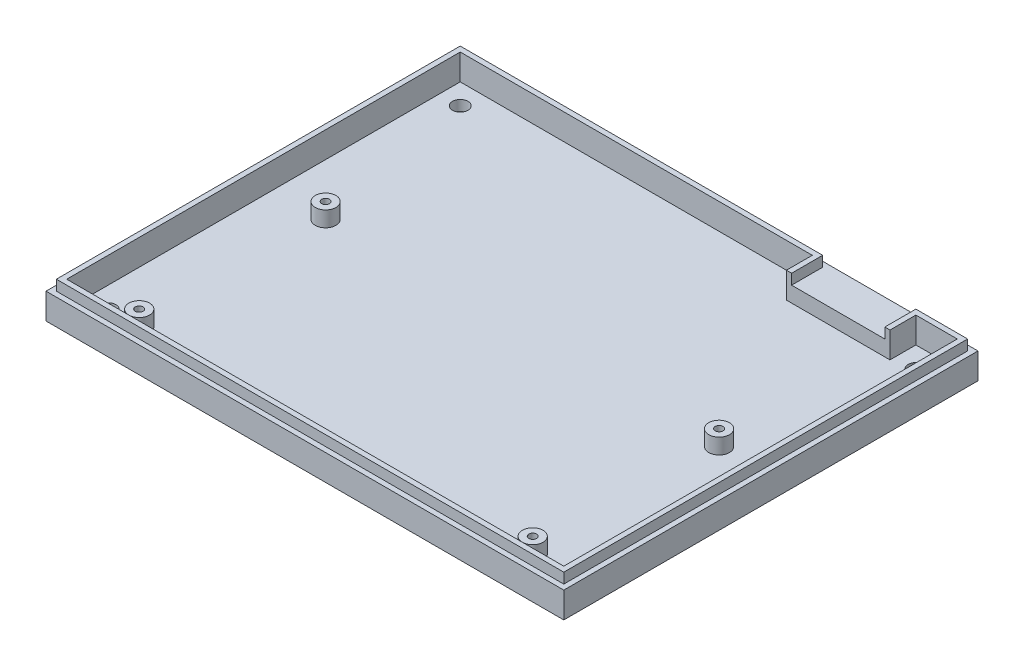
ISO-10303-21;
HEADER;
FILE_DESCRIPTION(('STEP AP214'),'2;1');
FILE_NAME('part.step','',(''),(''),'','','');
FILE_SCHEMA(('AUTOMOTIVE_DESIGN { 1 0 10303 214 1 1 1 1 }'));
ENDSEC;
DATA;
#1=APPLICATION_CONTEXT('core data for automotive mechanical design processes');
#2=APPLICATION_PROTOCOL_DEFINITION('international standard','automotive_design',2000,#1);
#3=PRODUCT_CONTEXT('',#1,'mechanical');
#4=PRODUCT('Part','Part','',(#3));
#5=PRODUCT_RELATED_PRODUCT_CATEGORY('part','',(#4));
#6=PRODUCT_DEFINITION_FORMATION('','',#4);
#7=PRODUCT_DEFINITION_CONTEXT('part definition',#1,'design');
#8=PRODUCT_DEFINITION('design','',#6,#7);
#9=PRODUCT_DEFINITION_SHAPE('','',#8);
#10=(LENGTH_UNIT() NAMED_UNIT(*) SI_UNIT(.MILLI.,.METRE.));
#11=(NAMED_UNIT(*) PLANE_ANGLE_UNIT() SI_UNIT($,.RADIAN.));
#12=(NAMED_UNIT(*) SI_UNIT($,.STERADIAN.) SOLID_ANGLE_UNIT());
#13=UNCERTAINTY_MEASURE_WITH_UNIT(LENGTH_MEASURE(1.E-05),#10,'distance_accuracy_value','');
#14=(GEOMETRIC_REPRESENTATION_CONTEXT(3) GLOBAL_UNCERTAINTY_ASSIGNED_CONTEXT((#13)) GLOBAL_UNIT_ASSIGNED_CONTEXT((#10,
#11,#12)) REPRESENTATION_CONTEXT('',''));
#15=CARTESIAN_POINT('',(0.,0.,0.));
#16=DIRECTION('',(0.,0.,1.));
#17=DIRECTION('',(1.,0.,0.));
#18=AXIS2_PLACEMENT_3D('',#15,#16,#17);
#19=CARTESIAN_POINT('',(49.,7.,-39.));
#20=DIRECTION('',(0.,0.,1.));
#21=DIRECTION('',(1.,0.,0.));
#22=AXIS2_PLACEMENT_3D('',#19,#20,#21);
#23=PLANE('',#22);
#24=DIRECTION('',(-1.,0.,0.));
#25=VECTOR('',#24,1.);
#26=CARTESIAN_POINT('',(49.,7.,-39.));
#27=LINE('',#26,#25);
#28=CARTESIAN_POINT('',(21.,7.,-39.));
#29=VERTEX_POINT('',#28);
#30=CARTESIAN_POINT('',(-49.,7.,-39.));
#31=VERTEX_POINT('',#30);
#32=EDGE_CURVE('E257',#29,#31,#27,.T.);
#33=ORIENTED_EDGE('',*,*,#32,.F.);
#34=DIRECTION('',(0.,-1.,0.));
#35=VECTOR('',#34,1.);
#36=CARTESIAN_POINT('',(21.,7.,-39.));
#37=LINE('',#36,#35);
#38=CARTESIAN_POINT('',(21.,5.,-39.));
#39=VERTEX_POINT('',#38);
#40=EDGE_CURVE('E14',#29,#39,#37,.T.);
#41=ORIENTED_EDGE('',*,*,#40,.T.);
#42=DIRECTION('',(-1.,0.,0.));
#43=VECTOR('',#42,1.);
#44=CARTESIAN_POINT('',(49.,5.,-39.));
#45=LINE('',#44,#43);
#46=CARTESIAN_POINT('',(-49.,5.,-39.));
#47=VERTEX_POINT('',#46);
#48=EDGE_CURVE('E255',#39,#47,#45,.T.);
#49=ORIENTED_EDGE('',*,*,#48,.T.);
#50=DIRECTION('',(0.,-1.,0.));
#51=VECTOR('',#50,1.);
#52=CARTESIAN_POINT('',(-49.,7.,-39.));
#53=LINE('',#52,#51);
#54=EDGE_CURVE('E276',#31,#47,#53,.T.);
#55=ORIENTED_EDGE('',*,*,#54,.F.);
#56=EDGE_LOOP('',(#33,#41,#49,#55));
#57=FACE_BOUND('',#56,.T.);
#58=ADVANCED_FACE('F105',(#57),#23,.F.);
#59=CARTESIAN_POINT('',(0.,5.,-38.));
#60=DIRECTION('',(0.,0.,1.));
#61=DIRECTION('',(1.,0.,0.));
#62=AXIS2_PLACEMENT_3D('',#59,#60,#61);
#63=PLANE('',#62);
#64=DIRECTION('',(-1.,0.,0.));
#65=VECTOR('',#64,1.);
#66=CARTESIAN_POINT('',(48.,7.,-38.));
#67=LINE('',#66,#65);
#68=CARTESIAN_POINT('',(48.,7.,-38.));
#69=VERTEX_POINT('',#68);
#70=CARTESIAN_POINT('',(40.,7.,-38.));
#71=VERTEX_POINT('',#70);
#72=EDGE_CURVE('E433',#69,#71,#67,.T.);
#73=ORIENTED_EDGE('',*,*,#72,.T.);
#74=DIRECTION('',(0.,-1.,0.));
#75=VECTOR('',#74,1.);
#76=CARTESIAN_POINT('',(40.,5.,-38.));
#77=LINE('',#76,#75);
#78=CARTESIAN_POINT('',(40.,2.,-38.));
#79=VERTEX_POINT('',#78);
#80=EDGE_CURVE('E120',#71,#79,#77,.T.);
#81=ORIENTED_EDGE('',*,*,#80,.T.);
#82=DIRECTION('',(-1.,0.,0.));
#83=VECTOR('',#82,1.);
#84=CARTESIAN_POINT('',(0.,2.,-38.));
#85=LINE('',#84,#83);
#86=CARTESIAN_POINT('',(48.,2.,-38.));
#87=VERTEX_POINT('',#86);
#88=EDGE_CURVE('E358',#87,#79,#85,.T.);
#89=ORIENTED_EDGE('',*,*,#88,.F.);
#90=DIRECTION('',(0.,-1.,0.));
#91=VECTOR('',#90,1.);
#92=CARTESIAN_POINT('',(48.,5.,-38.));
#93=LINE('',#92,#91);
#94=EDGE_CURVE('E375',#69,#87,#93,.T.);
#95=ORIENTED_EDGE('',*,*,#94,.F.);
#96=EDGE_LOOP('',(#73,#81,#89,#95));
#97=FACE_BOUND('',#96,.T.);
#98=ADVANCED_FACE('F506',(#97),#63,.T.);
#99=DIRECTION('',(0.,-1.,0.));
#100=VECTOR('',#99,1.);
#101=CARTESIAN_POINT('',(20.,5.,-38.));
#102=LINE('',#101,#100);
#103=CARTESIAN_POINT('',(20.,7.,-38.));
#104=VERTEX_POINT('',#103);
#105=CARTESIAN_POINT('',(20.,2.,-38.));
#106=VERTEX_POINT('',#105);
#107=EDGE_CURVE('E470',#104,#106,#102,.T.);
#108=ORIENTED_EDGE('',*,*,#107,.F.);
#109=CARTESIAN_POINT('',(-48.,7.,-38.));
#110=VERTEX_POINT('',#109);
#111=EDGE_CURVE('E437',#104,#110,#67,.T.);
#112=ORIENTED_EDGE('',*,*,#111,.T.);
#113=DIRECTION('',(0.,-1.,0.));
#114=VECTOR('',#113,1.);
#115=CARTESIAN_POINT('',(-48.,5.,-38.));
#116=LINE('',#115,#114);
#117=CARTESIAN_POINT('',(-48.,2.,-38.));
#118=VERTEX_POINT('',#117);
#119=EDGE_CURVE('E357',#110,#118,#116,.T.);
#120=ORIENTED_EDGE('',*,*,#119,.T.);
#121=EDGE_CURVE('E344',#106,#118,#85,.T.);
#122=ORIENTED_EDGE('',*,*,#121,.F.);
#123=EDGE_LOOP('',(#108,#112,#120,#122));
#124=FACE_BOUND('',#123,.T.);
#125=ADVANCED_FACE('F508',(#124),#63,.T.);
#126=CARTESIAN_POINT('',(0.,2.,0.));
#127=DIRECTION('',(0.,-1.,0.));
#128=DIRECTION('',(0.,0.,-1.));
#129=AXIS2_PLACEMENT_3D('',#126,#127,#128);
#130=PLANE('',#129);
#131=CARTESIAN_POINT('',(38.,2.,34.));
#132=DIRECTION('',(0.,-1.,0.));
#133=DIRECTION('',(0.,0.,-1.));
#134=AXIS2_PLACEMENT_3D('',#131,#132,#133);
#135=CIRCLE('',#134,2.);
#136=CARTESIAN_POINT('',(38.,2.,32.));
#137=VERTEX_POINT('',#136);
#138=EDGE_CURVE('E398',#137,#137,#135,.F.);
#139=ORIENTED_EDGE('',*,*,#138,.F.);
#140=EDGE_LOOP('',(#139));
#141=FACE_BOUND('',#140,.T.);
#142=CARTESIAN_POINT('',(38.,2.,-2.00000000000001));
#143=DIRECTION('',(0.,-1.,0.));
#144=DIRECTION('',(0.,0.,-1.));
#145=AXIS2_PLACEMENT_3D('',#142,#143,#144);
#146=CIRCLE('',#145,2.);
#147=CARTESIAN_POINT('',(38.,2.,-4.00000000000001));
#148=VERTEX_POINT('',#147);
#149=EDGE_CURVE('E401',#148,#148,#146,.F.);
#150=ORIENTED_EDGE('',*,*,#149,.F.);
#151=EDGE_LOOP('',(#150));
#152=FACE_BOUND('',#151,.T.);
#153=CARTESIAN_POINT('',(-38.,2.,34.));
#154=DIRECTION('',(0.,-1.,0.));
#155=DIRECTION('',(0.,0.,-1.));
#156=AXIS2_PLACEMENT_3D('',#153,#154,#155);
#157=CIRCLE('',#156,2.);
#158=CARTESIAN_POINT('',(-38.,2.,32.));
#159=VERTEX_POINT('',#158);
#160=EDGE_CURVE('E404',#159,#159,#157,.F.);
#161=ORIENTED_EDGE('',*,*,#160,.F.);
#162=EDGE_LOOP('',(#161));
#163=FACE_BOUND('',#162,.T.);
#164=CARTESIAN_POINT('',(-38.,2.,-2.));
#165=DIRECTION('',(0.,-1.,0.));
#166=DIRECTION('',(0.,0.,-1.));
#167=AXIS2_PLACEMENT_3D('',#164,#165,#166);
#168=CIRCLE('',#167,2.);
#169=CARTESIAN_POINT('',(-38.,2.,-4.));
#170=VERTEX_POINT('',#169);
#171=EDGE_CURVE('E407',#170,#170,#168,.F.);
#172=ORIENTED_EDGE('',*,*,#171,.F.);
#173=EDGE_LOOP('',(#172));
#174=FACE_BOUND('',#173,.T.);
#175=CARTESIAN_POINT('',(-44.,2.,-34.));
#176=DIRECTION('',(0.,1.,0.));
#177=DIRECTION('',(0.,0.,1.));
#178=AXIS2_PLACEMENT_3D('',#175,#176,#177);
#179=CIRCLE('',#178,1.5);
#180=CARTESIAN_POINT('',(-44.,2.,-32.5));
#181=VERTEX_POINT('',#180);
#182=EDGE_CURVE('E302',#181,#181,#179,.T.);
#183=ORIENTED_EDGE('',*,*,#182,.F.);
#184=EDGE_LOOP('',(#183));
#185=FACE_BOUND('',#184,.T.);
#186=CARTESIAN_POINT('',(-44.,2.,34.));
#187=DIRECTION('',(0.,1.,0.));
#188=DIRECTION('',(0.,0.,-1.));
#189=AXIS2_PLACEMENT_3D('',#186,#187,#188);
#190=CIRCLE('',#189,1.5);
#191=CARTESIAN_POINT('',(-44.,2.,32.5));
#192=VERTEX_POINT('',#191);
#193=EDGE_CURVE('E284',#192,#192,#190,.T.);
#194=ORIENTED_EDGE('',*,*,#193,.F.);
#195=EDGE_LOOP('',(#194));
#196=FACE_BOUND('',#195,.T.);
#197=CARTESIAN_POINT('',(44.0000000000001,2.,33.9999999999999));
#198=DIRECTION('',(0.,1.,0.));
#199=DIRECTION('',(0.,0.,1.));
#200=AXIS2_PLACEMENT_3D('',#197,#198,#199);
#201=CIRCLE('',#200,1.50000000000001);
#202=CARTESIAN_POINT('',(44.0000000000001,2.,35.4999999999999));
#203=VERTEX_POINT('',#202);
#204=EDGE_CURVE('E289',#203,#203,#201,.T.);
#205=ORIENTED_EDGE('',*,*,#204,.F.);
#206=EDGE_LOOP('',(#205));
#207=FACE_BOUND('',#206,.T.);
#208=CARTESIAN_POINT('',(44.,2.,-34.));
#209=DIRECTION('',(0.,1.,0.));
#210=DIRECTION('',(0.,0.,-1.));
#211=AXIS2_PLACEMENT_3D('',#208,#209,#210);
#212=CIRCLE('',#211,1.50000000000001);
#213=CARTESIAN_POINT('',(44.,2.,-35.5));
#214=VERTEX_POINT('',#213);
#215=EDGE_CURVE('E285',#214,#214,#212,.T.);
#216=ORIENTED_EDGE('',*,*,#215,.F.);
#217=EDGE_LOOP('',(#216));
#218=FACE_BOUND('',#217,.T.);
#219=DIRECTION('',(0.,0.,1.));
#220=VECTOR('',#219,1.);
#221=CARTESIAN_POINT('',(20.,2.,-33.));
#222=LINE('',#221,#220);
#223=CARTESIAN_POINT('',(20.,2.,-33.));
#224=VERTEX_POINT('',#223);
#225=EDGE_CURVE('E468',#106,#224,#222,.T.);
#226=ORIENTED_EDGE('',*,*,#225,.F.);
#227=ORIENTED_EDGE('',*,*,#121,.T.);
#228=DIRECTION('',(0.,0.,1.));
#229=VECTOR('',#228,1.);
#230=CARTESIAN_POINT('',(-48.,2.,0.));
#231=LINE('',#230,#229);
#232=CARTESIAN_POINT('',(-48.,2.,38.));
#233=VERTEX_POINT('',#232);
#234=EDGE_CURVE('E348',#118,#233,#231,.T.);
#235=ORIENTED_EDGE('',*,*,#234,.T.);
#236=DIRECTION('',(1.,0.,0.));
#237=VECTOR('',#236,1.);
#238=CARTESIAN_POINT('',(0.,2.,38.));
#239=LINE('',#238,#237);
#240=CARTESIAN_POINT('',(48.,2.,38.));
#241=VERTEX_POINT('',#240);
#242=EDGE_CURVE('E363',#233,#241,#239,.T.);
#243=ORIENTED_EDGE('',*,*,#242,.T.);
#244=DIRECTION('',(0.,0.,-1.));
#245=VECTOR('',#244,1.);
#246=CARTESIAN_POINT('',(48.,2.,0.));
#247=LINE('',#246,#245);
#248=EDGE_CURVE('E360',#241,#87,#247,.T.);
#249=ORIENTED_EDGE('',*,*,#248,.T.);
#250=ORIENTED_EDGE('',*,*,#88,.T.);
#251=DIRECTION('',(0.,0.,-1.));
#252=VECTOR('',#251,1.);
#253=CARTESIAN_POINT('',(40.,2.,-38.));
#254=LINE('',#253,#252);
#255=CARTESIAN_POINT('',(40.,2.,-33.));
#256=VERTEX_POINT('',#255);
#257=EDGE_CURVE('E471',#256,#79,#254,.T.);
#258=ORIENTED_EDGE('',*,*,#257,.F.);
#259=DIRECTION('',(1.,0.,0.));
#260=VECTOR('',#259,1.);
#261=CARTESIAN_POINT('',(40.,2.,-33.));
#262=LINE('',#261,#260);
#263=EDGE_CURVE('E474',#224,#256,#262,.T.);
#264=ORIENTED_EDGE('',*,*,#263,.F.);
#265=EDGE_LOOP('',(#226,#227,#235,#243,#249,#250,#258,#264));
#266=FACE_BOUND('',#265,.T.);
#267=ADVANCED_FACE('F504',(#141,#152,#163,#174,#185,#196,#207,#218,#266),#130,.F.);
#268=CARTESIAN_POINT('',(0.,5.,0.));
#269=DIRECTION('',(0.,1.,0.));
#270=DIRECTION('',(0.,0.,1.));
#271=AXIS2_PLACEMENT_3D('',#268,#269,#270);
#272=PLANE('',#271);
#273=ORIENTED_EDGE('',*,*,#48,.F.);
#274=DIRECTION('',(0.,0.,-1.));
#275=VECTOR('',#274,1.);
#276=CARTESIAN_POINT('',(21.,5.,-38.));
#277=LINE('',#276,#275);
#278=CARTESIAN_POINT('',(21.,5.,-33.));
#279=VERTEX_POINT('',#278);
#280=EDGE_CURVE('E244',#279,#39,#277,.T.);
#281=ORIENTED_EDGE('',*,*,#280,.F.);
#282=DIRECTION('',(1.,0.,0.));
#283=VECTOR('',#282,1.);
#284=CARTESIAN_POINT('',(40.,5.,-33.));
#285=LINE('',#284,#283);
#286=CARTESIAN_POINT('',(39.,5.,-33.));
#287=VERTEX_POINT('',#286);
#288=EDGE_CURVE('E128',#279,#287,#285,.T.);
#289=ORIENTED_EDGE('',*,*,#288,.T.);
#290=DIRECTION('',(0.,0.,1.));
#291=VECTOR('',#290,1.);
#292=CARTESIAN_POINT('',(39.,5.,-38.));
#293=LINE('',#292,#291);
#294=CARTESIAN_POINT('',(39.,5.,-39.));
#295=VERTEX_POINT('',#294);
#296=EDGE_CURVE('E451',#295,#287,#293,.T.);
#297=ORIENTED_EDGE('',*,*,#296,.F.);
#298=CARTESIAN_POINT('',(49.,5.,-39.));
#299=VERTEX_POINT('',#298);
#300=EDGE_CURVE('E263',#299,#295,#45,.T.);
#301=ORIENTED_EDGE('',*,*,#300,.F.);
#302=DIRECTION('',(0.,0.,-1.));
#303=VECTOR('',#302,1.);
#304=CARTESIAN_POINT('',(49.,5.,39.));
#305=LINE('',#304,#303);
#306=CARTESIAN_POINT('',(49.,5.,39.));
#307=VERTEX_POINT('',#306);
#308=EDGE_CURVE('E264',#307,#299,#305,.T.);
#309=ORIENTED_EDGE('',*,*,#308,.F.);
#310=DIRECTION('',(1.,0.,0.));
#311=VECTOR('',#310,1.);
#312=CARTESIAN_POINT('',(-49.,5.,39.));
#313=LINE('',#312,#311);
#314=CARTESIAN_POINT('',(-49.,5.,39.));
#315=VERTEX_POINT('',#314);
#316=EDGE_CURVE('E267',#315,#307,#313,.T.);
#317=ORIENTED_EDGE('',*,*,#316,.F.);
#318=DIRECTION('',(0.,0.,1.));
#319=VECTOR('',#318,1.);
#320=CARTESIAN_POINT('',(-49.,5.,-39.));
#321=LINE('',#320,#319);
#322=EDGE_CURVE('E262',#47,#315,#321,.T.);
#323=ORIENTED_EDGE('',*,*,#322,.F.);
#324=EDGE_LOOP('',(#273,#281,#289,#297,#301,#309,#317,#323));
#325=FACE_BOUND('',#324,.T.);
#326=DIRECTION('',(-1.,0.,0.));
#327=VECTOR('',#326,1.);
#328=CARTESIAN_POINT('',(0.,5.,-40.));
#329=LINE('',#328,#327);
#330=CARTESIAN_POINT('',(50.,5.,-40.));
#331=VERTEX_POINT('',#330);
#332=CARTESIAN_POINT('',(-50.,5.,-40.));
#333=VERTEX_POINT('',#332);
#334=EDGE_CURVE('E345',#331,#333,#329,.T.);
#335=ORIENTED_EDGE('',*,*,#334,.T.);
#336=DIRECTION('',(0.,0.,1.));
#337=VECTOR('',#336,1.);
#338=CARTESIAN_POINT('',(-50.,5.,0.));
#339=LINE('',#338,#337);
#340=CARTESIAN_POINT('',(-50.,5.,40.));
#341=VERTEX_POINT('',#340);
#342=EDGE_CURVE('E347',#333,#341,#339,.T.);
#343=ORIENTED_EDGE('',*,*,#342,.T.);
#344=DIRECTION('',(1.,0.,0.));
#345=VECTOR('',#344,1.);
#346=CARTESIAN_POINT('',(0.,5.,40.));
#347=LINE('',#346,#345);
#348=CARTESIAN_POINT('',(50.,5.,40.));
#349=VERTEX_POINT('',#348);
#350=EDGE_CURVE('E351',#341,#349,#347,.T.);
#351=ORIENTED_EDGE('',*,*,#350,.T.);
#352=DIRECTION('',(0.,0.,-1.));
#353=VECTOR('',#352,1.);
#354=CARTESIAN_POINT('',(50.,5.,0.));
#355=LINE('',#354,#353);
#356=EDGE_CURVE('E354',#349,#331,#355,.T.);
#357=ORIENTED_EDGE('',*,*,#356,.T.);
#358=EDGE_LOOP('',(#335,#343,#351,#357));
#359=FACE_BOUND('',#358,.T.);
#360=ADVANCED_FACE('F259',(#325,#359),#272,.T.);
#361=CARTESIAN_POINT('',(-50.,2.,-40.));
#362=DIRECTION('',(1.,0.,0.));
#363=DIRECTION('',(0.,0.,-1.));
#364=AXIS2_PLACEMENT_3D('',#361,#362,#363);
#365=PLANE('',#364);
#366=DIRECTION('',(0.,0.,1.));
#367=VECTOR('',#366,1.);
#368=CARTESIAN_POINT('',(-50.,0.,-40.));
#369=LINE('',#368,#367);
#370=CARTESIAN_POINT('',(-50.,0.,-40.));
#371=VERTEX_POINT('',#370);
#372=CARTESIAN_POINT('',(-50.,0.,40.));
#373=VERTEX_POINT('',#372);
#374=EDGE_CURVE('E377',#371,#373,#369,.T.);
#375=ORIENTED_EDGE('',*,*,#374,.T.);
#376=DIRECTION('',(0.,-1.,0.));
#377=VECTOR('',#376,1.);
#378=CARTESIAN_POINT('',(-50.,2.,40.));
#379=LINE('',#378,#377);
#380=EDGE_CURVE('E395',#341,#373,#379,.T.);
#381=ORIENTED_EDGE('',*,*,#380,.F.);
#382=ORIENTED_EDGE('',*,*,#342,.F.);
#383=DIRECTION('',(0.,-1.,0.));
#384=VECTOR('',#383,1.);
#385=CARTESIAN_POINT('',(-50.,2.,-40.));
#386=LINE('',#385,#384);
#387=EDGE_CURVE('E386',#333,#371,#386,.T.);
#388=ORIENTED_EDGE('',*,*,#387,.T.);
#389=EDGE_LOOP('',(#375,#381,#382,#388));
#390=FACE_BOUND('',#389,.T.);
#391=ADVANCED_FACE('F107',(#390),#365,.F.);
#392=CARTESIAN_POINT('',(50.,2.,40.));
#393=DIRECTION('',(0.,0.,-1.));
#394=DIRECTION('',(-1.,0.,0.));
#395=AXIS2_PLACEMENT_3D('',#392,#393,#394);
#396=PLANE('',#395);
#397=DIRECTION('',(1.,0.,0.));
#398=VECTOR('',#397,1.);
#399=CARTESIAN_POINT('',(50.,0.,40.));
#400=LINE('',#399,#398);
#401=CARTESIAN_POINT('',(50.,0.,40.));
#402=VERTEX_POINT('',#401);
#403=EDGE_CURVE('E380',#373,#402,#400,.T.);
#404=ORIENTED_EDGE('',*,*,#403,.T.);
#405=DIRECTION('',(0.,-1.,0.));
#406=VECTOR('',#405,1.);
#407=CARTESIAN_POINT('',(50.,2.,40.));
#408=LINE('',#407,#406);
#409=EDGE_CURVE('E392',#349,#402,#408,.T.);
#410=ORIENTED_EDGE('',*,*,#409,.F.);
#411=ORIENTED_EDGE('',*,*,#350,.F.);
#412=ORIENTED_EDGE('',*,*,#380,.T.);
#413=EDGE_LOOP('',(#404,#410,#411,#412));
#414=FACE_BOUND('',#413,.T.);
#415=ADVANCED_FACE('F532',(#414),#396,.F.);
#416=CARTESIAN_POINT('',(50.,2.,-40.));
#417=DIRECTION('',(-1.,0.,0.));
#418=DIRECTION('',(0.,0.,1.));
#419=AXIS2_PLACEMENT_3D('',#416,#417,#418);
#420=PLANE('',#419);
#421=DIRECTION('',(0.,0.,-1.));
#422=VECTOR('',#421,1.);
#423=CARTESIAN_POINT('',(50.,0.,-40.));
#424=LINE('',#423,#422);
#425=CARTESIAN_POINT('',(50.,0.,-40.));
#426=VERTEX_POINT('',#425);
#427=EDGE_CURVE('E382',#402,#426,#424,.T.);
#428=ORIENTED_EDGE('',*,*,#427,.T.);
#429=DIRECTION('',(0.,-1.,0.));
#430=VECTOR('',#429,1.);
#431=CARTESIAN_POINT('',(50.,2.,-40.));
#432=LINE('',#431,#430);
#433=EDGE_CURVE('E389',#331,#426,#432,.T.);
#434=ORIENTED_EDGE('',*,*,#433,.F.);
#435=ORIENTED_EDGE('',*,*,#356,.F.);
#436=ORIENTED_EDGE('',*,*,#409,.T.);
#437=EDGE_LOOP('',(#428,#434,#435,#436));
#438=FACE_BOUND('',#437,.T.);
#439=ADVANCED_FACE('F529',(#438),#420,.F.);
#440=CARTESIAN_POINT('',(50.,2.,-40.));
#441=DIRECTION('',(0.,0.,1.));
#442=DIRECTION('',(1.,0.,0.));
#443=AXIS2_PLACEMENT_3D('',#440,#441,#442);
#444=PLANE('',#443);
#445=DIRECTION('',(-1.,0.,0.));
#446=VECTOR('',#445,1.);
#447=CARTESIAN_POINT('',(50.,0.,-40.));
#448=LINE('',#447,#446);
#449=EDGE_CURVE('E384',#426,#371,#448,.T.);
#450=ORIENTED_EDGE('',*,*,#449,.T.);
#451=ORIENTED_EDGE('',*,*,#387,.F.);
#452=ORIENTED_EDGE('',*,*,#334,.F.);
#453=ORIENTED_EDGE('',*,*,#433,.T.);
#454=EDGE_LOOP('',(#450,#451,#452,#453));
#455=FACE_BOUND('',#454,.T.);
#456=ADVANCED_FACE('F525',(#455),#444,.F.);
#457=CARTESIAN_POINT('',(0.,0.,0.));
#458=DIRECTION('',(0.,-1.,0.));
#459=DIRECTION('',(0.,0.,-1.));
#460=AXIS2_PLACEMENT_3D('',#457,#458,#459);
#461=PLANE('',#460);
#462=CARTESIAN_POINT('',(44.,0.,-34.));
#463=DIRECTION('',(0.,-1.,0.));
#464=DIRECTION('',(0.,0.,-1.));
#465=AXIS2_PLACEMENT_3D('',#462,#463,#464);
#466=CIRCLE('',#465,1.50000000000001);
#467=CARTESIAN_POINT('',(44.,0.,-35.5));
#468=VERTEX_POINT('',#467);
#469=EDGE_CURVE('E299',#468,#468,#466,.T.);
#470=ORIENTED_EDGE('',*,*,#469,.F.);
#471=EDGE_LOOP('',(#470));
#472=FACE_BOUND('',#471,.T.);
#473=CARTESIAN_POINT('',(44.0000000000001,0.,33.9999999999999));
#474=DIRECTION('',(0.,-1.,0.));
#475=DIRECTION('',(0.,0.,-1.));
#476=AXIS2_PLACEMENT_3D('',#473,#474,#475);
#477=CIRCLE('',#476,1.50000000000001);
#478=CARTESIAN_POINT('',(44.0000000000001,0.,32.4999999999999));
#479=VERTEX_POINT('',#478);
#480=EDGE_CURVE('E296',#479,#479,#477,.T.);
#481=ORIENTED_EDGE('',*,*,#480,.F.);
#482=EDGE_LOOP('',(#481));
#483=FACE_BOUND('',#482,.T.);
#484=CARTESIAN_POINT('',(-44.,0.,34.));
#485=DIRECTION('',(0.,-1.,0.));
#486=DIRECTION('',(0.,0.,-1.));
#487=AXIS2_PLACEMENT_3D('',#484,#485,#486);
#488=CIRCLE('',#487,1.5);
#489=CARTESIAN_POINT('',(-44.,0.,32.5));
#490=VERTEX_POINT('',#489);
#491=EDGE_CURVE('E288',#490,#490,#488,.T.);
#492=ORIENTED_EDGE('',*,*,#491,.F.);
#493=EDGE_LOOP('',(#492));
#494=FACE_BOUND('',#493,.T.);
#495=CARTESIAN_POINT('',(-44.,0.,-34.));
#496=DIRECTION('',(0.,-1.,0.));
#497=DIRECTION('',(0.,0.,-1.));
#498=AXIS2_PLACEMENT_3D('',#495,#496,#497);
#499=CIRCLE('',#498,1.5);
#500=CARTESIAN_POINT('',(-44.,0.,-35.5));
#501=VERTEX_POINT('',#500);
#502=EDGE_CURVE('E305',#501,#501,#499,.T.);
#503=ORIENTED_EDGE('',*,*,#502,.F.);
#504=EDGE_LOOP('',(#503));
#505=FACE_BOUND('',#504,.T.);
#506=CARTESIAN_POINT('',(-38.,0.,-2.));
#507=DIRECTION('',(0.,1.,0.));
#508=DIRECTION('',(0.,0.,1.));
#509=AXIS2_PLACEMENT_3D('',#506,#507,#508);
#510=CIRCLE('',#509,0.749999999999999);
#511=CARTESIAN_POINT('',(-38.,0.,-1.25));
#512=VERTEX_POINT('',#511);
#513=EDGE_CURVE('E316',#512,#512,#510,.T.);
#514=ORIENTED_EDGE('',*,*,#513,.T.);
#515=EDGE_LOOP('',(#514));
#516=FACE_BOUND('',#515,.T.);
#517=CARTESIAN_POINT('',(38.,0.,34.));
#518=DIRECTION('',(0.,1.,0.));
#519=DIRECTION('',(0.,0.,1.));
#520=AXIS2_PLACEMENT_3D('',#517,#518,#519);
#521=CIRCLE('',#520,0.749999999999999);
#522=CARTESIAN_POINT('',(38.,0.,34.75));
#523=VERTEX_POINT('',#522);
#524=EDGE_CURVE('E309',#523,#523,#521,.T.);
#525=ORIENTED_EDGE('',*,*,#524,.T.);
#526=EDGE_LOOP('',(#525));
#527=FACE_BOUND('',#526,.T.);
#528=CARTESIAN_POINT('',(38.,0.,-2.00000000000001));
#529=DIRECTION('',(0.,1.,0.));
#530=DIRECTION('',(0.,0.,1.));
#531=AXIS2_PLACEMENT_3D('',#528,#529,#530);
#532=CIRCLE('',#531,0.749999999999999);
#533=CARTESIAN_POINT('',(38.,0.,-1.25000000000001));
#534=VERTEX_POINT('',#533);
#535=EDGE_CURVE('E321',#534,#534,#532,.T.);
#536=ORIENTED_EDGE('',*,*,#535,.T.);
#537=EDGE_LOOP('',(#536));
#538=FACE_BOUND('',#537,.T.);
#539=CARTESIAN_POINT('',(-38.,0.,34.));
#540=DIRECTION('',(0.,1.,0.));
#541=DIRECTION('',(0.,0.,1.));
#542=AXIS2_PLACEMENT_3D('',#539,#540,#541);
#543=CIRCLE('',#542,0.749999999999999);
#544=CARTESIAN_POINT('',(-38.,0.,34.75));
#545=VERTEX_POINT('',#544);
#546=EDGE_CURVE('E327',#545,#545,#543,.T.);
#547=ORIENTED_EDGE('',*,*,#546,.T.);
#548=EDGE_LOOP('',(#547));
#549=FACE_BOUND('',#548,.T.);
#550=ORIENTED_EDGE('',*,*,#374,.F.);
#551=ORIENTED_EDGE('',*,*,#449,.F.);
#552=ORIENTED_EDGE('',*,*,#427,.F.);
#553=ORIENTED_EDGE('',*,*,#403,.F.);
#554=EDGE_LOOP('',(#550,#551,#552,#553));
#555=FACE_BOUND('',#554,.T.);
#556=ADVANCED_FACE('F522',(#472,#483,#494,#505,#516,#527,#538,#549,#555),#461,.T.);
#557=CARTESIAN_POINT('',(48.,5.,0.));
#558=DIRECTION('',(-1.,0.,0.));
#559=DIRECTION('',(0.,0.,1.));
#560=AXIS2_PLACEMENT_3D('',#557,#558,#559);
#561=PLANE('',#560);
#562=ORIENTED_EDGE('',*,*,#248,.F.);
#563=DIRECTION('',(0.,-1.,0.));
#564=VECTOR('',#563,1.);
#565=CARTESIAN_POINT('',(48.,5.,38.));
#566=LINE('',#565,#564);
#567=CARTESIAN_POINT('',(48.,7.,38.));
#568=VERTEX_POINT('',#567);
#569=EDGE_CURVE('E373',#568,#241,#566,.T.);
#570=ORIENTED_EDGE('',*,*,#569,.F.);
#571=DIRECTION('',(0.,0.,-1.));
#572=VECTOR('',#571,1.);
#573=CARTESIAN_POINT('',(48.,7.,38.));
#574=LINE('',#573,#572);
#575=EDGE_CURVE('E442',#568,#69,#574,.T.);
#576=ORIENTED_EDGE('',*,*,#575,.T.);
#577=ORIENTED_EDGE('',*,*,#94,.T.);
#578=EDGE_LOOP('',(#562,#570,#576,#577));
#579=FACE_BOUND('',#578,.T.);
#580=ADVANCED_FACE('F497',(#579),#561,.T.);
#581=CARTESIAN_POINT('',(0.,5.,38.));
#582=DIRECTION('',(0.,0.,-1.));
#583=DIRECTION('',(-1.,0.,0.));
#584=AXIS2_PLACEMENT_3D('',#581,#582,#583);
#585=PLANE('',#584);
#586=ORIENTED_EDGE('',*,*,#242,.F.);
#587=DIRECTION('',(0.,-1.,0.));
#588=VECTOR('',#587,1.);
#589=CARTESIAN_POINT('',(-48.,5.,38.));
#590=LINE('',#589,#588);
#591=CARTESIAN_POINT('',(-48.,7.,38.));
#592=VERTEX_POINT('',#591);
#593=EDGE_CURVE('E370',#592,#233,#590,.T.);
#594=ORIENTED_EDGE('',*,*,#593,.F.);
#595=DIRECTION('',(1.,0.,0.));
#596=VECTOR('',#595,1.);
#597=CARTESIAN_POINT('',(-48.,7.,38.));
#598=LINE('',#597,#596);
#599=EDGE_CURVE('E489',#592,#568,#598,.T.);
#600=ORIENTED_EDGE('',*,*,#599,.T.);
#601=ORIENTED_EDGE('',*,*,#569,.T.);
#602=EDGE_LOOP('',(#586,#594,#600,#601));
#603=FACE_BOUND('',#602,.T.);
#604=ADVANCED_FACE('F559',(#603),#585,.T.);
#605=CARTESIAN_POINT('',(-48.,5.,0.));
#606=DIRECTION('',(1.,0.,0.));
#607=DIRECTION('',(0.,0.,-1.));
#608=AXIS2_PLACEMENT_3D('',#605,#606,#607);
#609=PLANE('',#608);
#610=ORIENTED_EDGE('',*,*,#234,.F.);
#611=ORIENTED_EDGE('',*,*,#119,.F.);
#612=DIRECTION('',(0.,0.,1.));
#613=VECTOR('',#612,1.);
#614=CARTESIAN_POINT('',(-48.,7.,-38.));
#615=LINE('',#614,#613);
#616=EDGE_CURVE('E487',#110,#592,#615,.T.);
#617=ORIENTED_EDGE('',*,*,#616,.T.);
#618=ORIENTED_EDGE('',*,*,#593,.T.);
#619=EDGE_LOOP('',(#610,#611,#617,#618));
#620=FACE_BOUND('',#619,.T.);
#621=ADVANCED_FACE('F557',(#620),#609,.T.);
#622=CARTESIAN_POINT('',(38.,5.,34.));
#623=DIRECTION('',(0.,-1.,0.));
#624=DIRECTION('',(0.,0.,-1.));
#625=AXIS2_PLACEMENT_3D('',#622,#623,#624);
#626=CYLINDRICAL_SURFACE('',#625,2.);
#627=CARTESIAN_POINT('',(38.,5.,34.));
#628=DIRECTION('',(0.,1.,0.));
#629=DIRECTION('',(0.,0.,1.));
#630=AXIS2_PLACEMENT_3D('',#627,#628,#629);
#631=CIRCLE('',#630,2.);
#632=CARTESIAN_POINT('',(38.,5.,36.));
#633=VERTEX_POINT('',#632);
#634=EDGE_CURVE('E341',#633,#633,#631,.T.);
#635=ORIENTED_EDGE('',*,*,#634,.F.);
#636=EDGE_LOOP('',(#635));
#637=FACE_BOUND('',#636,.T.);
#638=ORIENTED_EDGE('',*,*,#138,.T.);
#639=EDGE_LOOP('',(#638));
#640=FACE_BOUND('',#639,.T.);
#641=ADVANCED_FACE('F555',(#637,#640),#626,.T.);
#642=CARTESIAN_POINT('',(0.,5.,0.));
#643=DIRECTION('',(0.,1.,0.));
#644=DIRECTION('',(0.,0.,1.));
#645=AXIS2_PLACEMENT_3D('',#642,#643,#644);
#646=PLANE('',#645);
#647=CARTESIAN_POINT('',(38.,5.,34.));
#648=DIRECTION('',(0.,1.,0.));
#649=DIRECTION('',(0.,0.,1.));
#650=AXIS2_PLACEMENT_3D('',#647,#648,#649);
#651=CIRCLE('',#650,0.749999999999999);
#652=CARTESIAN_POINT('',(38.,5.,34.75));
#653=VERTEX_POINT('',#652);
#654=EDGE_CURVE('E313',#653,#653,#651,.T.);
#655=ORIENTED_EDGE('',*,*,#654,.F.);
#656=EDGE_LOOP('',(#655));
#657=FACE_BOUND('',#656,.T.);
#658=ORIENTED_EDGE('',*,*,#634,.T.);
#659=EDGE_LOOP('',(#658));
#660=FACE_BOUND('',#659,.T.);
#661=ADVANCED_FACE('F645',(#657,#660),#646,.T.);
#662=CARTESIAN_POINT('',(38.,5.,-2.00000000000001));
#663=DIRECTION('',(0.,-1.,0.));
#664=DIRECTION('',(0.,0.,-1.));
#665=AXIS2_PLACEMENT_3D('',#662,#663,#664);
#666=CYLINDRICAL_SURFACE('',#665,2.);
#667=CARTESIAN_POINT('',(38.,5.,-2.00000000000001));
#668=DIRECTION('',(0.,1.,0.));
#669=DIRECTION('',(0.,0.,1.));
#670=AXIS2_PLACEMENT_3D('',#667,#668,#669);
#671=CIRCLE('',#670,2.);
#672=CARTESIAN_POINT('',(38.,5.,0.));
#673=VERTEX_POINT('',#672);
#674=EDGE_CURVE('E338',#673,#673,#671,.T.);
#675=ORIENTED_EDGE('',*,*,#674,.F.);
#676=EDGE_LOOP('',(#675));
#677=FACE_BOUND('',#676,.T.);
#678=ORIENTED_EDGE('',*,*,#149,.T.);
#679=EDGE_LOOP('',(#678));
#680=FACE_BOUND('',#679,.T.);
#681=ADVANCED_FACE('F642',(#677,#680),#666,.T.);
#682=CARTESIAN_POINT('',(0.,5.,0.));
#683=DIRECTION('',(0.,1.,0.));
#684=DIRECTION('',(0.,0.,1.));
#685=AXIS2_PLACEMENT_3D('',#682,#683,#684);
#686=PLANE('',#685);
#687=CARTESIAN_POINT('',(38.,5.,-2.00000000000001));
#688=DIRECTION('',(0.,1.,0.));
#689=DIRECTION('',(0.,0.,1.));
#690=AXIS2_PLACEMENT_3D('',#687,#688,#689);
#691=CIRCLE('',#690,0.749999999999999);
#692=CARTESIAN_POINT('',(38.,5.,-1.25000000000001));
#693=VERTEX_POINT('',#692);
#694=EDGE_CURVE('E312',#693,#693,#691,.T.);
#695=ORIENTED_EDGE('',*,*,#694,.F.);
#696=EDGE_LOOP('',(#695));
#697=FACE_BOUND('',#696,.T.);
#698=ORIENTED_EDGE('',*,*,#674,.T.);
#699=EDGE_LOOP('',(#698));
#700=FACE_BOUND('',#699,.T.);
#701=ADVANCED_FACE('F638',(#697,#700),#686,.T.);
#702=CARTESIAN_POINT('',(-38.,5.,34.));
#703=DIRECTION('',(0.,-1.,0.));
#704=DIRECTION('',(0.,0.,-1.));
#705=AXIS2_PLACEMENT_3D('',#702,#703,#704);
#706=CYLINDRICAL_SURFACE('',#705,2.);
#707=CARTESIAN_POINT('',(-38.,5.,34.));
#708=DIRECTION('',(0.,1.,0.));
#709=DIRECTION('',(0.,0.,1.));
#710=AXIS2_PLACEMENT_3D('',#707,#708,#709);
#711=CIRCLE('',#710,2.);
#712=CARTESIAN_POINT('',(-38.,5.,36.));
#713=VERTEX_POINT('',#712);
#714=EDGE_CURVE('E335',#713,#713,#711,.T.);
#715=ORIENTED_EDGE('',*,*,#714,.F.);
#716=EDGE_LOOP('',(#715));
#717=FACE_BOUND('',#716,.T.);
#718=ORIENTED_EDGE('',*,*,#160,.T.);
#719=EDGE_LOOP('',(#718));
#720=FACE_BOUND('',#719,.T.);
#721=ADVANCED_FACE('F634',(#717,#720),#706,.T.);
#722=CARTESIAN_POINT('',(0.,5.,0.));
#723=DIRECTION('',(0.,1.,0.));
#724=DIRECTION('',(0.,0.,1.));
#725=AXIS2_PLACEMENT_3D('',#722,#723,#724);
#726=PLANE('',#725);
#727=CARTESIAN_POINT('',(-38.,5.,34.));
#728=DIRECTION('',(0.,1.,0.));
#729=DIRECTION('',(0.,0.,1.));
#730=AXIS2_PLACEMENT_3D('',#727,#728,#729);
#731=CIRCLE('',#730,0.749999999999999);
#732=CARTESIAN_POINT('',(-38.,5.,34.75));
#733=VERTEX_POINT('',#732);
#734=EDGE_CURVE('E324',#733,#733,#731,.T.);
#735=ORIENTED_EDGE('',*,*,#734,.F.);
#736=EDGE_LOOP('',(#735));
#737=FACE_BOUND('',#736,.T.);
#738=ORIENTED_EDGE('',*,*,#714,.T.);
#739=EDGE_LOOP('',(#738));
#740=FACE_BOUND('',#739,.T.);
#741=ADVANCED_FACE('F630',(#737,#740),#726,.T.);
#742=CARTESIAN_POINT('',(-38.,5.,-2.));
#743=DIRECTION('',(0.,-1.,0.));
#744=DIRECTION('',(0.,0.,-1.));
#745=AXIS2_PLACEMENT_3D('',#742,#743,#744);
#746=CYLINDRICAL_SURFACE('',#745,2.);
#747=CARTESIAN_POINT('',(-38.,5.,-2.));
#748=DIRECTION('',(0.,1.,0.));
#749=DIRECTION('',(0.,0.,1.));
#750=AXIS2_PLACEMENT_3D('',#747,#748,#749);
#751=CIRCLE('',#750,2.);
#752=CARTESIAN_POINT('',(-38.,5.,0.));
#753=VERTEX_POINT('',#752);
#754=EDGE_CURVE('E330',#753,#753,#751,.T.);
#755=ORIENTED_EDGE('',*,*,#754,.F.);
#756=EDGE_LOOP('',(#755));
#757=FACE_BOUND('',#756,.T.);
#758=ORIENTED_EDGE('',*,*,#171,.T.);
#759=EDGE_LOOP('',(#758));
#760=FACE_BOUND('',#759,.T.);
#761=ADVANCED_FACE('F626',(#757,#760),#746,.T.);
#762=CARTESIAN_POINT('',(0.,5.,0.));
#763=DIRECTION('',(0.,1.,0.));
#764=DIRECTION('',(0.,0.,1.));
#765=AXIS2_PLACEMENT_3D('',#762,#763,#764);
#766=PLANE('',#765);
#767=CARTESIAN_POINT('',(-38.,5.,-2.));
#768=DIRECTION('',(0.,1.,0.));
#769=DIRECTION('',(0.,0.,1.));
#770=AXIS2_PLACEMENT_3D('',#767,#768,#769);
#771=CIRCLE('',#770,0.749999999999999);
#772=CARTESIAN_POINT('',(-38.,5.,-1.25));
#773=VERTEX_POINT('',#772);
#774=EDGE_CURVE('E308',#773,#773,#771,.T.);
#775=ORIENTED_EDGE('',*,*,#774,.F.);
#776=EDGE_LOOP('',(#775));
#777=FACE_BOUND('',#776,.T.);
#778=ORIENTED_EDGE('',*,*,#754,.T.);
#779=EDGE_LOOP('',(#778));
#780=FACE_BOUND('',#779,.T.);
#781=ADVANCED_FACE('F622',(#777,#780),#766,.T.);
#782=CARTESIAN_POINT('',(-38.,0.,34.));
#783=DIRECTION('',(0.,1.,0.));
#784=DIRECTION('',(0.,0.,1.));
#785=AXIS2_PLACEMENT_3D('',#782,#783,#784);
#786=CYLINDRICAL_SURFACE('',#785,0.749999999999999);
#787=ORIENTED_EDGE('',*,*,#546,.F.);
#788=EDGE_LOOP('',(#787));
#789=FACE_BOUND('',#788,.T.);
#790=ORIENTED_EDGE('',*,*,#734,.T.);
#791=EDGE_LOOP('',(#790));
#792=FACE_BOUND('',#791,.T.);
#793=ADVANCED_FACE('F615',(#789,#792),#786,.F.);
#794=CARTESIAN_POINT('',(-38.,0.,-2.));
#795=DIRECTION('',(0.,1.,0.));
#796=DIRECTION('',(0.,0.,1.));
#797=AXIS2_PLACEMENT_3D('',#794,#795,#796);
#798=CYLINDRICAL_SURFACE('',#797,0.749999999999999);
#799=ORIENTED_EDGE('',*,*,#513,.F.);
#800=EDGE_LOOP('',(#799));
#801=FACE_BOUND('',#800,.T.);
#802=ORIENTED_EDGE('',*,*,#774,.T.);
#803=EDGE_LOOP('',(#802));
#804=FACE_BOUND('',#803,.T.);
#805=ADVANCED_FACE('F612',(#801,#804),#798,.F.);
#806=CARTESIAN_POINT('',(38.,0.,-2.00000000000001));
#807=DIRECTION('',(0.,1.,0.));
#808=DIRECTION('',(0.,0.,1.));
#809=AXIS2_PLACEMENT_3D('',#806,#807,#808);
#810=CYLINDRICAL_SURFACE('',#809,0.749999999999999);
#811=ORIENTED_EDGE('',*,*,#535,.F.);
#812=EDGE_LOOP('',(#811));
#813=FACE_BOUND('',#812,.T.);
#814=ORIENTED_EDGE('',*,*,#694,.T.);
#815=EDGE_LOOP('',(#814));
#816=FACE_BOUND('',#815,.T.);
#817=ADVANCED_FACE('F610',(#813,#816),#810,.F.);
#818=CARTESIAN_POINT('',(38.,0.,34.));
#819=DIRECTION('',(0.,1.,0.));
#820=DIRECTION('',(0.,0.,1.));
#821=AXIS2_PLACEMENT_3D('',#818,#819,#820);
#822=CYLINDRICAL_SURFACE('',#821,0.749999999999999);
#823=ORIENTED_EDGE('',*,*,#524,.F.);
#824=EDGE_LOOP('',(#823));
#825=FACE_BOUND('',#824,.T.);
#826=ORIENTED_EDGE('',*,*,#654,.T.);
#827=EDGE_LOOP('',(#826));
#828=FACE_BOUND('',#827,.T.);
#829=ADVANCED_FACE('F606',(#825,#828),#822,.F.);
#830=CARTESIAN_POINT('',(-44.,-3.,-34.));
#831=DIRECTION('',(0.,1.,0.));
#832=DIRECTION('',(0.,0.,1.));
#833=AXIS2_PLACEMENT_3D('',#830,#831,#832);
#834=CYLINDRICAL_SURFACE('',#833,1.5);
#835=ORIENTED_EDGE('',*,*,#502,.T.);
#836=EDGE_LOOP('',(#835));
#837=FACE_BOUND('',#836,.T.);
#838=ORIENTED_EDGE('',*,*,#182,.T.);
#839=EDGE_LOOP('',(#838));
#840=FACE_BOUND('',#839,.T.);
#841=ADVANCED_FACE('F602',(#837,#840),#834,.F.);
#842=CARTESIAN_POINT('',(-44.,-3.,34.));
#843=DIRECTION('',(0.,1.,0.));
#844=DIRECTION('',(0.,0.,1.));
#845=AXIS2_PLACEMENT_3D('',#842,#843,#844);
#846=CYLINDRICAL_SURFACE('',#845,1.5);
#847=ORIENTED_EDGE('',*,*,#491,.T.);
#848=EDGE_LOOP('',(#847));
#849=FACE_BOUND('',#848,.T.);
#850=ORIENTED_EDGE('',*,*,#193,.T.);
#851=EDGE_LOOP('',(#850));
#852=FACE_BOUND('',#851,.T.);
#853=ADVANCED_FACE('F598',(#849,#852),#846,.F.);
#854=CARTESIAN_POINT('',(44.0000000000001,-3.,33.9999999999999));
#855=DIRECTION('',(0.,1.,0.));
#856=DIRECTION('',(0.,0.,1.));
#857=AXIS2_PLACEMENT_3D('',#854,#855,#856);
#858=CYLINDRICAL_SURFACE('',#857,1.50000000000001);
#859=ORIENTED_EDGE('',*,*,#480,.T.);
#860=EDGE_LOOP('',(#859));
#861=FACE_BOUND('',#860,.T.);
#862=ORIENTED_EDGE('',*,*,#204,.T.);
#863=EDGE_LOOP('',(#862));
#864=FACE_BOUND('',#863,.T.);
#865=ADVANCED_FACE('F594',(#861,#864),#858,.F.);
#866=CARTESIAN_POINT('',(44.,-3.,-34.));
#867=DIRECTION('',(0.,1.,0.));
#868=DIRECTION('',(0.,0.,1.));
#869=AXIS2_PLACEMENT_3D('',#866,#867,#868);
#870=CYLINDRICAL_SURFACE('',#869,1.50000000000001);
#871=ORIENTED_EDGE('',*,*,#469,.T.);
#872=EDGE_LOOP('',(#871));
#873=FACE_BOUND('',#872,.T.);
#874=ORIENTED_EDGE('',*,*,#215,.T.);
#875=EDGE_LOOP('',(#874));
#876=FACE_BOUND('',#875,.T.);
#877=ADVANCED_FACE('F585',(#873,#876),#870,.F.);
#878=CARTESIAN_POINT('',(0.,7.,0.));
#879=DIRECTION('',(0.,1.,0.));
#880=DIRECTION('',(0.,0.,1.));
#881=AXIS2_PLACEMENT_3D('',#878,#879,#880);
#882=PLANE('',#881);
#883=DIRECTION('',(0.,0.,-1.));
#884=VECTOR('',#883,1.);
#885=CARTESIAN_POINT('',(21.,7.,-38.));
#886=LINE('',#885,#884);
#887=CARTESIAN_POINT('',(21.,7.,-33.));
#888=VERTEX_POINT('',#887);
#889=EDGE_CURVE('E462',#888,#29,#886,.T.);
#890=ORIENTED_EDGE('',*,*,#889,.T.);
#891=ORIENTED_EDGE('',*,*,#32,.T.);
#892=DIRECTION('',(0.,0.,1.));
#893=VECTOR('',#892,1.);
#894=CARTESIAN_POINT('',(-49.,7.,-39.));
#895=LINE('',#894,#893);
#896=CARTESIAN_POINT('',(-49.,7.,39.));
#897=VERTEX_POINT('',#896);
#898=EDGE_CURVE('E277',#31,#897,#895,.T.);
#899=ORIENTED_EDGE('',*,*,#898,.T.);
#900=DIRECTION('',(1.,0.,0.));
#901=VECTOR('',#900,1.);
#902=CARTESIAN_POINT('',(-49.,7.,39.));
#903=LINE('',#902,#901);
#904=CARTESIAN_POINT('',(49.,7.,39.));
#905=VERTEX_POINT('',#904);
#906=EDGE_CURVE('E272',#897,#905,#903,.T.);
#907=ORIENTED_EDGE('',*,*,#906,.T.);
#908=DIRECTION('',(0.,0.,-1.));
#909=VECTOR('',#908,1.);
#910=CARTESIAN_POINT('',(49.,7.,39.));
#911=LINE('',#910,#909);
#912=CARTESIAN_POINT('',(49.,7.,-39.));
#913=VERTEX_POINT('',#912);
#914=EDGE_CURVE('E426',#905,#913,#911,.T.);
#915=ORIENTED_EDGE('',*,*,#914,.T.);
#916=CARTESIAN_POINT('',(39.,7.,-39.));
#917=VERTEX_POINT('',#916);
#918=EDGE_CURVE('E415',#913,#917,#27,.T.);
#919=ORIENTED_EDGE('',*,*,#918,.T.);
#920=DIRECTION('',(0.,0.,1.));
#921=VECTOR('',#920,1.);
#922=CARTESIAN_POINT('',(39.,7.,-38.));
#923=LINE('',#922,#921);
#924=CARTESIAN_POINT('',(39.,7.,-33.));
#925=VERTEX_POINT('',#924);
#926=EDGE_CURVE('E423',#917,#925,#923,.T.);
#927=ORIENTED_EDGE('',*,*,#926,.T.);
#928=DIRECTION('',(1.,0.,0.));
#929=VECTOR('',#928,1.);
#930=CARTESIAN_POINT('',(39.,7.,-33.));
#931=LINE('',#930,#929);
#932=CARTESIAN_POINT('',(40.,7.,-33.));
#933=VERTEX_POINT('',#932);
#934=EDGE_CURVE('E453',#925,#933,#931,.T.);
#935=ORIENTED_EDGE('',*,*,#934,.T.);
#936=DIRECTION('',(0.,0.,-1.));
#937=VECTOR('',#936,1.);
#938=CARTESIAN_POINT('',(40.,7.,-33.));
#939=LINE('',#938,#937);
#940=EDGE_CURVE('E457',#933,#71,#939,.T.);
#941=ORIENTED_EDGE('',*,*,#940,.T.);
#942=ORIENTED_EDGE('',*,*,#72,.F.);
#943=ORIENTED_EDGE('',*,*,#575,.F.);
#944=ORIENTED_EDGE('',*,*,#599,.F.);
#945=ORIENTED_EDGE('',*,*,#616,.F.);
#946=ORIENTED_EDGE('',*,*,#111,.F.);
#947=DIRECTION('',(0.,0.,1.));
#948=VECTOR('',#947,1.);
#949=CARTESIAN_POINT('',(20.,7.,-33.));
#950=LINE('',#949,#948);
#951=CARTESIAN_POINT('',(20.,7.,-33.));
#952=VERTEX_POINT('',#951);
#953=EDGE_CURVE('E464',#104,#952,#950,.T.);
#954=ORIENTED_EDGE('',*,*,#953,.T.);
#955=DIRECTION('',(1.,0.,0.));
#956=VECTOR('',#955,1.);
#957=CARTESIAN_POINT('',(21.,7.,-33.));
#958=LINE('',#957,#956);
#959=EDGE_CURVE('E250',#952,#888,#958,.T.);
#960=ORIENTED_EDGE('',*,*,#959,.T.);
#961=EDGE_LOOP('',(#890,#891,#899,#907,#915,#919,#927,#935,#941,#942,#943,#944,#945,#946,#954,#960));
#962=FACE_BOUND('',#961,.T.);
#963=ADVANCED_FACE('F421',(#962),#882,.T.);
#964=CARTESIAN_POINT('',(-49.,7.,39.));
#965=DIRECTION('',(0.,0.,-1.));
#966=DIRECTION('',(-1.,0.,0.));
#967=AXIS2_PLACEMENT_3D('',#964,#965,#966);
#968=PLANE('',#967);
#969=ORIENTED_EDGE('',*,*,#316,.T.);
#970=DIRECTION('',(0.,-1.,0.));
#971=VECTOR('',#970,1.);
#972=CARTESIAN_POINT('',(49.,7.,39.));
#973=LINE('',#972,#971);
#974=EDGE_CURVE('E282',#905,#307,#973,.T.);
#975=ORIENTED_EDGE('',*,*,#974,.F.);
#976=ORIENTED_EDGE('',*,*,#906,.F.);
#977=DIRECTION('',(0.,-1.,0.));
#978=VECTOR('',#977,1.);
#979=CARTESIAN_POINT('',(-49.,7.,39.));
#980=LINE('',#979,#978);
#981=EDGE_CURVE('E273',#897,#315,#980,.T.);
#982=ORIENTED_EDGE('',*,*,#981,.T.);
#983=EDGE_LOOP('',(#969,#975,#976,#982));
#984=FACE_BOUND('',#983,.T.);
#985=ADVANCED_FACE('F448',(#984),#968,.F.);
#986=CARTESIAN_POINT('',(49.,7.,39.));
#987=DIRECTION('',(-1.,0.,0.));
#988=DIRECTION('',(0.,0.,1.));
#989=AXIS2_PLACEMENT_3D('',#986,#987,#988);
#990=PLANE('',#989);
#991=ORIENTED_EDGE('',*,*,#308,.T.);
#992=DIRECTION('',(0.,-1.,0.));
#993=VECTOR('',#992,1.);
#994=CARTESIAN_POINT('',(49.,7.,-39.));
#995=LINE('',#994,#993);
#996=EDGE_CURVE('E279',#913,#299,#995,.T.);
#997=ORIENTED_EDGE('',*,*,#996,.F.);
#998=ORIENTED_EDGE('',*,*,#914,.F.);
#999=ORIENTED_EDGE('',*,*,#974,.T.);
#1000=EDGE_LOOP('',(#991,#997,#998,#999));
#1001=FACE_BOUND('',#1000,.T.);
#1002=ADVANCED_FACE('F450',(#1001),#990,.F.);
#1003=ORIENTED_EDGE('',*,*,#300,.T.);
#1004=DIRECTION('',(0.,1.,0.));
#1005=VECTOR('',#1004,1.);
#1006=CARTESIAN_POINT('',(39.,7.,-39.));
#1007=LINE('',#1006,#1005);
#1008=EDGE_CURVE('E113',#295,#917,#1007,.T.);
#1009=ORIENTED_EDGE('',*,*,#1008,.T.);
#1010=ORIENTED_EDGE('',*,*,#918,.F.);
#1011=ORIENTED_EDGE('',*,*,#996,.T.);
#1012=EDGE_LOOP('',(#1003,#1009,#1010,#1011));
#1013=FACE_BOUND('',#1012,.T.);
#1014=ADVANCED_FACE('F414',(#1013),#23,.F.);
#1015=CARTESIAN_POINT('',(-49.,7.,-39.));
#1016=DIRECTION('',(1.,0.,0.));
#1017=DIRECTION('',(0.,0.,-1.));
#1018=AXIS2_PLACEMENT_3D('',#1015,#1016,#1017);
#1019=PLANE('',#1018);
#1020=ORIENTED_EDGE('',*,*,#322,.T.);
#1021=ORIENTED_EDGE('',*,*,#981,.F.);
#1022=ORIENTED_EDGE('',*,*,#898,.F.);
#1023=ORIENTED_EDGE('',*,*,#54,.T.);
#1024=EDGE_LOOP('',(#1020,#1021,#1022,#1023));
#1025=FACE_BOUND('',#1024,.T.);
#1026=ADVANCED_FACE('F573',(#1025),#1019,.F.);
#1027=CARTESIAN_POINT('',(20.,5.,-33.));
#1028=DIRECTION('',(1.,0.,0.));
#1029=DIRECTION('',(0.,0.,-1.));
#1030=AXIS2_PLACEMENT_3D('',#1027,#1028,#1029);
#1031=PLANE('',#1030);
#1032=ORIENTED_EDGE('',*,*,#225,.T.);
#1033=DIRECTION('',(0.,-1.,0.));
#1034=VECTOR('',#1033,1.);
#1035=CARTESIAN_POINT('',(20.,5.,-33.));
#1036=LINE('',#1035,#1034);
#1037=EDGE_CURVE('E484',#952,#224,#1036,.T.);
#1038=ORIENTED_EDGE('',*,*,#1037,.F.);
#1039=ORIENTED_EDGE('',*,*,#953,.F.);
#1040=ORIENTED_EDGE('',*,*,#107,.T.);
#1041=EDGE_LOOP('',(#1032,#1038,#1039,#1040));
#1042=FACE_BOUND('',#1041,.T.);
#1043=ADVANCED_FACE('F571',(#1042),#1031,.F.);
#1044=CARTESIAN_POINT('',(40.,5.,-33.));
#1045=DIRECTION('',(0.,0.,-1.));
#1046=DIRECTION('',(-1.,0.,0.));
#1047=AXIS2_PLACEMENT_3D('',#1044,#1045,#1046);
#1048=PLANE('',#1047);
#1049=ORIENTED_EDGE('',*,*,#263,.T.);
#1050=DIRECTION('',(0.,-1.,0.));
#1051=VECTOR('',#1050,1.);
#1052=CARTESIAN_POINT('',(40.,5.,-33.));
#1053=LINE('',#1052,#1051);
#1054=EDGE_CURVE('E481',#933,#256,#1053,.T.);
#1055=ORIENTED_EDGE('',*,*,#1054,.F.);
#1056=ORIENTED_EDGE('',*,*,#934,.F.);
#1057=DIRECTION('',(0.,-1.,0.));
#1058=VECTOR('',#1057,1.);
#1059=CARTESIAN_POINT('',(39.,7.,-33.));
#1060=LINE('',#1059,#1058);
#1061=EDGE_CURVE('E251',#925,#287,#1060,.T.);
#1062=ORIENTED_EDGE('',*,*,#1061,.T.);
#1063=ORIENTED_EDGE('',*,*,#288,.F.);
#1064=DIRECTION('',(0.,-1.,0.));
#1065=VECTOR('',#1064,1.);
#1066=CARTESIAN_POINT('',(21.,7.,-33.));
#1067=LINE('',#1066,#1065);
#1068=EDGE_CURVE('E248',#888,#279,#1067,.T.);
#1069=ORIENTED_EDGE('',*,*,#1068,.F.);
#1070=ORIENTED_EDGE('',*,*,#959,.F.);
#1071=ORIENTED_EDGE('',*,*,#1037,.T.);
#1072=EDGE_LOOP('',(#1049,#1055,#1056,#1062,#1063,#1069,#1070,#1071));
#1073=FACE_BOUND('',#1072,.T.);
#1074=ADVANCED_FACE('F501',(#1073),#1048,.F.);
#1075=CARTESIAN_POINT('',(40.,5.,-38.));
#1076=DIRECTION('',(-1.,0.,0.));
#1077=DIRECTION('',(0.,0.,1.));
#1078=AXIS2_PLACEMENT_3D('',#1075,#1076,#1077);
#1079=PLANE('',#1078);
#1080=ORIENTED_EDGE('',*,*,#257,.T.);
#1081=ORIENTED_EDGE('',*,*,#80,.F.);
#1082=ORIENTED_EDGE('',*,*,#940,.F.);
#1083=ORIENTED_EDGE('',*,*,#1054,.T.);
#1084=EDGE_LOOP('',(#1080,#1081,#1082,#1083));
#1085=FACE_BOUND('',#1084,.T.);
#1086=ADVANCED_FACE('F499',(#1085),#1079,.F.);
#1087=CARTESIAN_POINT('',(21.,7.,-38.));
#1088=DIRECTION('',(-1.,0.,0.));
#1089=DIRECTION('',(0.,0.,1.));
#1090=AXIS2_PLACEMENT_3D('',#1087,#1088,#1089);
#1091=PLANE('',#1090);
#1092=ORIENTED_EDGE('',*,*,#280,.T.);
#1093=ORIENTED_EDGE('',*,*,#40,.F.);
#1094=ORIENTED_EDGE('',*,*,#889,.F.);
#1095=ORIENTED_EDGE('',*,*,#1068,.T.);
#1096=EDGE_LOOP('',(#1092,#1093,#1094,#1095));
#1097=FACE_BOUND('',#1096,.T.);
#1098=ADVANCED_FACE('F245',(#1097),#1091,.F.);
#1099=CARTESIAN_POINT('',(39.,7.,-38.));
#1100=DIRECTION('',(1.,0.,0.));
#1101=DIRECTION('',(0.,0.,-1.));
#1102=AXIS2_PLACEMENT_3D('',#1099,#1100,#1101);
#1103=PLANE('',#1102);
#1104=ORIENTED_EDGE('',*,*,#296,.T.);
#1105=ORIENTED_EDGE('',*,*,#1061,.F.);
#1106=ORIENTED_EDGE('',*,*,#926,.F.);
#1107=ORIENTED_EDGE('',*,*,#1008,.F.);
#1108=EDGE_LOOP('',(#1104,#1105,#1106,#1107));
#1109=FACE_BOUND('',#1108,.T.);
#1110=ADVANCED_FACE('F792',(#1109),#1103,.F.);
#1111=CLOSED_SHELL('',(#58,#98,#125,#267,#360,#391,#415,#439,#456,#556,#580,#604,#621,#641,#661,
#681,#701,#721,#741,#761,#781,#793,#805,#817,#829,#841,#853,#865,#877,#963,#985,#1002,#1014,
#1026,#1043,#1074,#1086,#1098,#1110));
#1112=MANIFOLD_SOLID_BREP('B2',#1111);
#1113=ADVANCED_BREP_SHAPE_REPRESENTATION('',(#18,#1112),#14);
#1114=SHAPE_DEFINITION_REPRESENTATION(#9,#1113);
ENDSEC;
END-ISO-10303-21;
